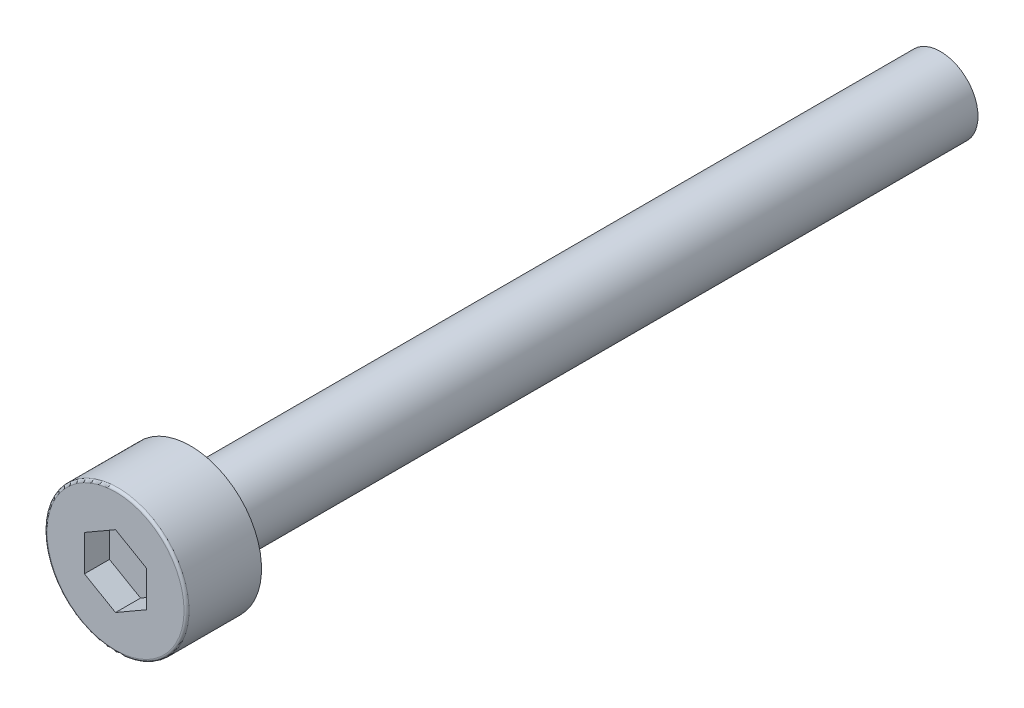
ISO-10303-21;
HEADER;
FILE_DESCRIPTION(('STEP AP214'),'2;1');
FILE_NAME('part.step','',(''),(''),'','','');
FILE_SCHEMA(('AUTOMOTIVE_DESIGN { 1 0 10303 214 1 1 1 1 }'));
ENDSEC;
DATA;
#1=APPLICATION_CONTEXT('core data for automotive mechanical design processes');
#2=APPLICATION_PROTOCOL_DEFINITION('international standard','automotive_design',2000,#1);
#3=PRODUCT_CONTEXT('',#1,'mechanical');
#4=PRODUCT('Part','Part','',(#3));
#5=PRODUCT_RELATED_PRODUCT_CATEGORY('part','',(#4));
#6=PRODUCT_DEFINITION_FORMATION('','',#4);
#7=PRODUCT_DEFINITION_CONTEXT('part definition',#1,'design');
#8=PRODUCT_DEFINITION('design','',#6,#7);
#9=PRODUCT_DEFINITION_SHAPE('','',#8);
#10=(LENGTH_UNIT() NAMED_UNIT(*) SI_UNIT(.MILLI.,.METRE.));
#11=(NAMED_UNIT(*) PLANE_ANGLE_UNIT() SI_UNIT($,.RADIAN.));
#12=(NAMED_UNIT(*) SI_UNIT($,.STERADIAN.) SOLID_ANGLE_UNIT());
#13=UNCERTAINTY_MEASURE_WITH_UNIT(LENGTH_MEASURE(1.E-05),#10,'distance_accuracy_value','');
#14=(GEOMETRIC_REPRESENTATION_CONTEXT(3) GLOBAL_UNCERTAINTY_ASSIGNED_CONTEXT((#13)) GLOBAL_UNIT_ASSIGNED_CONTEXT((#10,
#11,#12)) REPRESENTATION_CONTEXT('',''));
#15=CARTESIAN_POINT('',(0.,0.,0.));
#16=DIRECTION('',(0.,0.,1.));
#17=DIRECTION('',(1.,0.,0.));
#18=AXIS2_PLACEMENT_3D('',#15,#16,#17);
#19=CARTESIAN_POINT('',(0.,0.,2.));
#20=DIRECTION('',(0.,0.,1.));
#21=DIRECTION('',(1.,0.,0.));
#22=AXIS2_PLACEMENT_3D('',#19,#20,#21);
#23=PLANE('',#22);
#24=DIRECTION('',(-0.866025403784439,-0.5,0.));
#25=VECTOR('',#24,1.);
#26=CARTESIAN_POINT('',(0.,1.435,2.));
#27=LINE('',#26,#25);
#28=CARTESIAN_POINT('',(0.,1.435,2.));
#29=VERTEX_POINT('',#28);
#30=CARTESIAN_POINT('',(-1.24274645443067,0.7175,2.));
#31=VERTEX_POINT('',#30);
#32=EDGE_CURVE('E61',#29,#31,#27,.T.);
#33=ORIENTED_EDGE('',*,*,#32,.T.);
#34=DIRECTION('',(0.,-1.,0.));
#35=VECTOR('',#34,1.);
#36=CARTESIAN_POINT('',(-1.24274645443067,0.7175,2.));
#37=LINE('',#36,#35);
#38=CARTESIAN_POINT('',(-1.24274645443067,-0.7175,2.));
#39=VERTEX_POINT('',#38);
#40=EDGE_CURVE('E63',#31,#39,#37,.T.);
#41=ORIENTED_EDGE('',*,*,#40,.T.);
#42=DIRECTION('',(0.866025403784439,-0.5,0.));
#43=VECTOR('',#42,1.);
#44=CARTESIAN_POINT('',(-1.24274645443067,-0.7175,2.));
#45=LINE('',#44,#43);
#46=CARTESIAN_POINT('',(0.,-1.435,2.));
#47=VERTEX_POINT('',#46);
#48=EDGE_CURVE('E65',#39,#47,#45,.T.);
#49=ORIENTED_EDGE('',*,*,#48,.T.);
#50=DIRECTION('',(0.866025403784439,0.5,0.));
#51=VECTOR('',#50,1.);
#52=CARTESIAN_POINT('',(0.,-1.435,2.));
#53=LINE('',#52,#51);
#54=CARTESIAN_POINT('',(1.24274645443067,-0.717500000000001,2.));
#55=VERTEX_POINT('',#54);
#56=EDGE_CURVE('E134',#47,#55,#53,.T.);
#57=ORIENTED_EDGE('',*,*,#56,.T.);
#58=DIRECTION('',(0.,1.,0.));
#59=VECTOR('',#58,1.);
#60=CARTESIAN_POINT('',(1.24274645443067,-0.7175,2.));
#61=LINE('',#60,#59);
#62=CARTESIAN_POINT('',(1.24274645443067,0.7175,2.));
#63=VERTEX_POINT('',#62);
#64=EDGE_CURVE('E140',#55,#63,#61,.T.);
#65=ORIENTED_EDGE('',*,*,#64,.T.);
#66=DIRECTION('',(-0.866025403784439,0.5,0.));
#67=VECTOR('',#66,1.);
#68=CARTESIAN_POINT('',(1.24274645443067,0.717500000000001,2.));
#69=LINE('',#68,#67);
#70=EDGE_CURVE('E145',#63,#29,#69,.T.);
#71=ORIENTED_EDGE('',*,*,#70,.T.);
#72=EDGE_LOOP('',(#33,#41,#49,#57,#65,#71));
#73=FACE_BOUND('',#72,.T.);
#74=ADVANCED_FACE('F17',(#73),#23,.T.);
#75=CARTESIAN_POINT('',(-1.24274645443067,-0.7175,2.));
#76=DIRECTION('',(-0.5,-0.866025403784439,0.));
#77=DIRECTION('',(0.866025403784439,-0.5,0.));
#78=AXIS2_PLACEMENT_3D('',#75,#76,#77);
#79=PLANE('',#78);
#80=DIRECTION('',(0.,0.,1.));
#81=VECTOR('',#80,1.);
#82=CARTESIAN_POINT('',(0.,-1.435,2.));
#83=LINE('',#82,#81);
#84=CARTESIAN_POINT('',(0.,-1.435,3.));
#85=VERTEX_POINT('',#84);
#86=EDGE_CURVE('E79',#85,#47,#83,.F.);
#87=ORIENTED_EDGE('',*,*,#86,.T.);
#88=ORIENTED_EDGE('',*,*,#48,.F.);
#89=DIRECTION('',(0.,0.,1.));
#90=VECTOR('',#89,1.);
#91=CARTESIAN_POINT('',(-1.24274645443067,-0.7175,2.));
#92=LINE('',#91,#90);
#93=CARTESIAN_POINT('',(-1.24274645443067,-0.7175,3.));
#94=VERTEX_POINT('',#93);
#95=EDGE_CURVE('E71',#39,#94,#92,.T.);
#96=ORIENTED_EDGE('',*,*,#95,.T.);
#97=DIRECTION('',(-0.866025403784438,0.5,0.));
#98=VECTOR('',#97,1.);
#99=CARTESIAN_POINT('',(0.,-1.435,3.));
#100=LINE('',#99,#98);
#101=EDGE_CURVE('E133',#85,#94,#100,.T.);
#102=ORIENTED_EDGE('',*,*,#101,.F.);
#103=EDGE_LOOP('',(#87,#88,#96,#102));
#104=FACE_BOUND('',#103,.T.);
#105=ADVANCED_FACE('F75',(#104),#79,.F.);
#106=CARTESIAN_POINT('',(-1.24274645443067,0.7175,2.));
#107=DIRECTION('',(-1.,0.,0.));
#108=DIRECTION('',(0.,-1.,0.));
#109=AXIS2_PLACEMENT_3D('',#106,#107,#108);
#110=PLANE('',#109);
#111=ORIENTED_EDGE('',*,*,#95,.F.);
#112=ORIENTED_EDGE('',*,*,#40,.F.);
#113=DIRECTION('',(0.,0.,1.));
#114=VECTOR('',#113,1.);
#115=CARTESIAN_POINT('',(-1.24274645443067,0.7175,2.));
#116=LINE('',#115,#114);
#117=CARTESIAN_POINT('',(-1.24274645443067,0.7175,3.));
#118=VERTEX_POINT('',#117);
#119=EDGE_CURVE('E87',#31,#118,#116,.T.);
#120=ORIENTED_EDGE('',*,*,#119,.T.);
#121=DIRECTION('',(0.,1.,0.));
#122=VECTOR('',#121,1.);
#123=CARTESIAN_POINT('',(-1.24274645443067,0.,3.));
#124=LINE('',#123,#122);
#125=EDGE_CURVE('E84',#94,#118,#124,.T.);
#126=ORIENTED_EDGE('',*,*,#125,.F.);
#127=EDGE_LOOP('',(#111,#112,#120,#126));
#128=FACE_BOUND('',#127,.T.);
#129=ADVANCED_FACE('F82',(#128),#110,.F.);
#130=CARTESIAN_POINT('',(0.,1.435,2.));
#131=DIRECTION('',(-0.5,0.866025403784439,0.));
#132=DIRECTION('',(-0.866025403784439,-0.5,0.));
#133=AXIS2_PLACEMENT_3D('',#130,#131,#132);
#134=PLANE('',#133);
#135=ORIENTED_EDGE('',*,*,#119,.F.);
#136=ORIENTED_EDGE('',*,*,#32,.F.);
#137=DIRECTION('',(0.,0.,1.));
#138=VECTOR('',#137,1.);
#139=CARTESIAN_POINT('',(0.,1.435,2.));
#140=LINE('',#139,#138);
#141=CARTESIAN_POINT('',(0.,1.435,3.));
#142=VERTEX_POINT('',#141);
#143=EDGE_CURVE('E142',#29,#142,#140,.T.);
#144=ORIENTED_EDGE('',*,*,#143,.T.);
#145=DIRECTION('',(0.866025403784439,0.5,0.));
#146=VECTOR('',#145,1.);
#147=CARTESIAN_POINT('',(-1.24274645443067,0.7175,3.));
#148=LINE('',#147,#146);
#149=EDGE_CURVE('E152',#118,#142,#148,.T.);
#150=ORIENTED_EDGE('',*,*,#149,.F.);
#151=EDGE_LOOP('',(#135,#136,#144,#150));
#152=FACE_BOUND('',#151,.T.);
#153=ADVANCED_FACE('F153',(#152),#134,.F.);
#154=CARTESIAN_POINT('',(1.24274645443067,0.717500000000001,2.));
#155=DIRECTION('',(0.5,0.866025403784439,0.));
#156=DIRECTION('',(-0.866025403784439,0.5,0.));
#157=AXIS2_PLACEMENT_3D('',#154,#155,#156);
#158=PLANE('',#157);
#159=ORIENTED_EDGE('',*,*,#143,.F.);
#160=ORIENTED_EDGE('',*,*,#70,.F.);
#161=DIRECTION('',(0.,0.,1.));
#162=VECTOR('',#161,1.);
#163=CARTESIAN_POINT('',(1.24274645443067,0.717500000000001,2.));
#164=LINE('',#163,#162);
#165=CARTESIAN_POINT('',(1.24274645443067,0.717500000000001,3.));
#166=VERTEX_POINT('',#165);
#167=EDGE_CURVE('E137',#63,#166,#164,.T.);
#168=ORIENTED_EDGE('',*,*,#167,.T.);
#169=DIRECTION('',(0.866025403784439,-0.5,0.));
#170=VECTOR('',#169,1.);
#171=CARTESIAN_POINT('',(0.,1.435,3.));
#172=LINE('',#171,#170);
#173=EDGE_CURVE('E158',#142,#166,#172,.T.);
#174=ORIENTED_EDGE('',*,*,#173,.F.);
#175=EDGE_LOOP('',(#159,#160,#168,#174));
#176=FACE_BOUND('',#175,.T.);
#177=ADVANCED_FACE('F241',(#176),#158,.F.);
#178=CARTESIAN_POINT('',(1.24274645443067,-0.7175,2.));
#179=DIRECTION('',(1.,0.,0.));
#180=DIRECTION('',(0.,1.,0.));
#181=AXIS2_PLACEMENT_3D('',#178,#179,#180);
#182=PLANE('',#181);
#183=ORIENTED_EDGE('',*,*,#167,.F.);
#184=ORIENTED_EDGE('',*,*,#64,.F.);
#185=DIRECTION('',(0.,0.,1.));
#186=VECTOR('',#185,1.);
#187=CARTESIAN_POINT('',(1.24274645443067,-0.717500000000001,2.));
#188=LINE('',#187,#186);
#189=CARTESIAN_POINT('',(1.24274645443067,-0.717500000000001,3.));
#190=VERTEX_POINT('',#189);
#191=EDGE_CURVE('E125',#55,#190,#188,.T.);
#192=ORIENTED_EDGE('',*,*,#191,.T.);
#193=DIRECTION('',(0.,1.,0.));
#194=VECTOR('',#193,1.);
#195=CARTESIAN_POINT('',(1.24274645443067,0.,3.));
#196=LINE('',#195,#194);
#197=EDGE_CURVE('E166',#166,#190,#196,.F.);
#198=ORIENTED_EDGE('',*,*,#197,.F.);
#199=EDGE_LOOP('',(#183,#184,#192,#198));
#200=FACE_BOUND('',#199,.T.);
#201=ADVANCED_FACE('F191',(#200),#182,.F.);
#202=CARTESIAN_POINT('',(0.,-1.435,2.));
#203=DIRECTION('',(0.5,-0.866025403784439,0.));
#204=DIRECTION('',(0.866025403784439,0.5,0.));
#205=AXIS2_PLACEMENT_3D('',#202,#203,#204);
#206=PLANE('',#205);
#207=ORIENTED_EDGE('',*,*,#191,.F.);
#208=ORIENTED_EDGE('',*,*,#56,.F.);
#209=ORIENTED_EDGE('',*,*,#86,.F.);
#210=DIRECTION('',(-0.866025403784439,-0.5,0.));
#211=VECTOR('',#210,1.);
#212=CARTESIAN_POINT('',(1.24274645443067,-0.7175,3.));
#213=LINE('',#212,#211);
#214=EDGE_CURVE('E168',#190,#85,#213,.T.);
#215=ORIENTED_EDGE('',*,*,#214,.F.);
#216=EDGE_LOOP('',(#207,#208,#209,#215));
#217=FACE_BOUND('',#216,.T.);
#218=ADVANCED_FACE('F186',(#217),#206,.F.);
#219=CARTESIAN_POINT('',(0.,0.,3.));
#220=DIRECTION('',(0.,0.,1.));
#221=DIRECTION('',(1.,0.,0.));
#222=AXIS2_PLACEMENT_3D('',#219,#220,#221);
#223=PLANE('',#222);
#224=ORIENTED_EDGE('',*,*,#197,.T.);
#225=ORIENTED_EDGE('',*,*,#214,.T.);
#226=ORIENTED_EDGE('',*,*,#101,.T.);
#227=ORIENTED_EDGE('',*,*,#125,.T.);
#228=ORIENTED_EDGE('',*,*,#149,.T.);
#229=ORIENTED_EDGE('',*,*,#173,.T.);
#230=EDGE_LOOP('',(#224,#225,#226,#227,#228,#229));
#231=FACE_BOUND('',#230,.T.);
#232=CARTESIAN_POINT('',(0.,0.,3.));
#233=DIRECTION('',(0.,0.,-1.));
#234=DIRECTION('',(-1.,0.,0.));
#235=AXIS2_PLACEMENT_3D('',#232,#233,#234);
#236=CIRCLE('',#235,2.74);
#237=CARTESIAN_POINT('',(-2.74,0.,3.));
#238=VERTEX_POINT('',#237);
#239=CARTESIAN_POINT('',(2.74,0.,3.));
#240=VERTEX_POINT('',#239);
#241=EDGE_CURVE('E36',#238,#240,#236,.T.);
#242=ORIENTED_EDGE('',*,*,#241,.F.);
#243=CARTESIAN_POINT('',(0.,0.,3.));
#244=DIRECTION('',(0.,0.,-1.));
#245=DIRECTION('',(1.,0.,0.));
#246=AXIS2_PLACEMENT_3D('',#243,#244,#245);
#247=CIRCLE('',#246,2.74);
#248=EDGE_CURVE('E99',#240,#238,#247,.T.);
#249=ORIENTED_EDGE('',*,*,#248,.F.);
#250=EDGE_LOOP('',(#242,#249));
#251=FACE_BOUND('',#250,.T.);
#252=ADVANCED_FACE('F113',(#231,#251),#223,.T.);
#253=CARTESIAN_POINT('',(0.,0.,2.9));
#254=DIRECTION('',(0.,0.,1.));
#255=DIRECTION('',(1.,0.,0.));
#256=AXIS2_PLACEMENT_3D('',#253,#254,#255);
#257=TOROIDAL_SURFACE('',#256,2.74,0.1);
#258=CARTESIAN_POINT('',(0.,0.,2.9));
#259=DIRECTION('',(0.,0.,-1.));
#260=DIRECTION('',(-1.,0.,0.));
#261=AXIS2_PLACEMENT_3D('',#258,#259,#260);
#262=CIRCLE('',#261,2.84);
#263=CARTESIAN_POINT('',(-2.84,0.,2.9));
#264=VERTEX_POINT('',#263);
#265=EDGE_CURVE('E95',#264,#264,#262,.T.);
#266=ORIENTED_EDGE('',*,*,#265,.F.);
#267=EDGE_LOOP('',(#266));
#268=FACE_BOUND('',#267,.T.);
#269=ORIENTED_EDGE('',*,*,#248,.T.);
#270=ORIENTED_EDGE('',*,*,#241,.T.);
#271=EDGE_LOOP('',(#269,#270));
#272=FACE_BOUND('',#271,.T.);
#273=ADVANCED_FACE('F107',(#268,#272),#257,.T.);
#274=CARTESIAN_POINT('',(0.,0.,3.));
#275=DIRECTION('',(0.,0.,-1.));
#276=DIRECTION('',(-1.,0.,0.));
#277=AXIS2_PLACEMENT_3D('',#274,#275,#276);
#278=CYLINDRICAL_SURFACE('',#277,2.84);
#279=ORIENTED_EDGE('',*,*,#265,.T.);
#280=EDGE_LOOP('',(#279));
#281=FACE_BOUND('',#280,.T.);
#282=CARTESIAN_POINT('',(0.,0.,0.));
#283=DIRECTION('',(0.,0.,-1.));
#284=DIRECTION('',(-1.,0.,0.));
#285=AXIS2_PLACEMENT_3D('',#282,#283,#284);
#286=CIRCLE('',#285,2.84);
#287=CARTESIAN_POINT('',(-2.84,0.,0.));
#288=VERTEX_POINT('',#287);
#289=EDGE_CURVE('E93',#288,#288,#286,.F.);
#290=ORIENTED_EDGE('',*,*,#289,.T.);
#291=EDGE_LOOP('',(#290));
#292=FACE_BOUND('',#291,.T.);
#293=ADVANCED_FACE('F112',(#281,#292),#278,.T.);
#294=CARTESIAN_POINT('',(0.,0.,-30.));
#295=DIRECTION('',(0.,0.,-1.));
#296=DIRECTION('',(-1.,0.,0.));
#297=AXIS2_PLACEMENT_3D('',#294,#295,#296);
#298=PLANE('',#297);
#299=CARTESIAN_POINT('',(0.,0.,-30.));
#300=DIRECTION('',(0.,0.,1.));
#301=DIRECTION('',(1.,0.,0.));
#302=AXIS2_PLACEMENT_3D('',#299,#300,#301);
#303=CIRCLE('',#302,1.5);
#304=CARTESIAN_POINT('',(1.5,0.,-30.));
#305=VERTEX_POINT('',#304);
#306=EDGE_CURVE('E28',#305,#305,#303,.T.);
#307=ORIENTED_EDGE('',*,*,#306,.F.);
#308=EDGE_LOOP('',(#307));
#309=FACE_BOUND('',#308,.T.);
#310=ADVANCED_FACE('F201',(#309),#298,.T.);
#311=CARTESIAN_POINT('',(0.,0.,0.));
#312=DIRECTION('',(0.,0.,1.));
#313=DIRECTION('',(1.,0.,0.));
#314=AXIS2_PLACEMENT_3D('',#311,#312,#313);
#315=PLANE('',#314);
#316=CARTESIAN_POINT('',(0.,0.,0.));
#317=DIRECTION('',(0.,0.,1.));
#318=DIRECTION('',(1.,0.,0.));
#319=AXIS2_PLACEMENT_3D('',#316,#317,#318);
#320=CIRCLE('',#319,1.5);
#321=CARTESIAN_POINT('',(1.5,0.,0.));
#322=VERTEX_POINT('',#321);
#323=EDGE_CURVE('E11',#322,#322,#320,.F.);
#324=ORIENTED_EDGE('',*,*,#323,.F.);
#325=EDGE_LOOP('',(#324));
#326=FACE_BOUND('',#325,.T.);
#327=ORIENTED_EDGE('',*,*,#289,.F.);
#328=EDGE_LOOP('',(#327));
#329=FACE_BOUND('',#328,.T.);
#330=ADVANCED_FACE('F195',(#326,#329),#315,.F.);
#331=CARTESIAN_POINT('',(0.,0.,-30.));
#332=DIRECTION('',(0.,0.,1.));
#333=DIRECTION('',(1.,0.,0.));
#334=AXIS2_PLACEMENT_3D('',#331,#332,#333);
#335=CYLINDRICAL_SURFACE('',#334,1.5);
#336=ORIENTED_EDGE('',*,*,#323,.T.);
#337=EDGE_LOOP('',(#336));
#338=FACE_BOUND('',#337,.T.);
#339=ORIENTED_EDGE('',*,*,#306,.T.);
#340=EDGE_LOOP('',(#339));
#341=FACE_BOUND('',#340,.T.);
#342=ADVANCED_FACE('F193',(#338,#341),#335,.T.);
#343=CLOSED_SHELL('',(#74,#105,#129,#153,#177,#201,#218,#252,#273,#293,#310,#330,#342));
#344=MANIFOLD_SOLID_BREP('B1',#343);
#345=ADVANCED_BREP_SHAPE_REPRESENTATION('',(#18,#344),#14);
#346=SHAPE_DEFINITION_REPRESENTATION(#9,#345);
ENDSEC;
END-ISO-10303-21;
